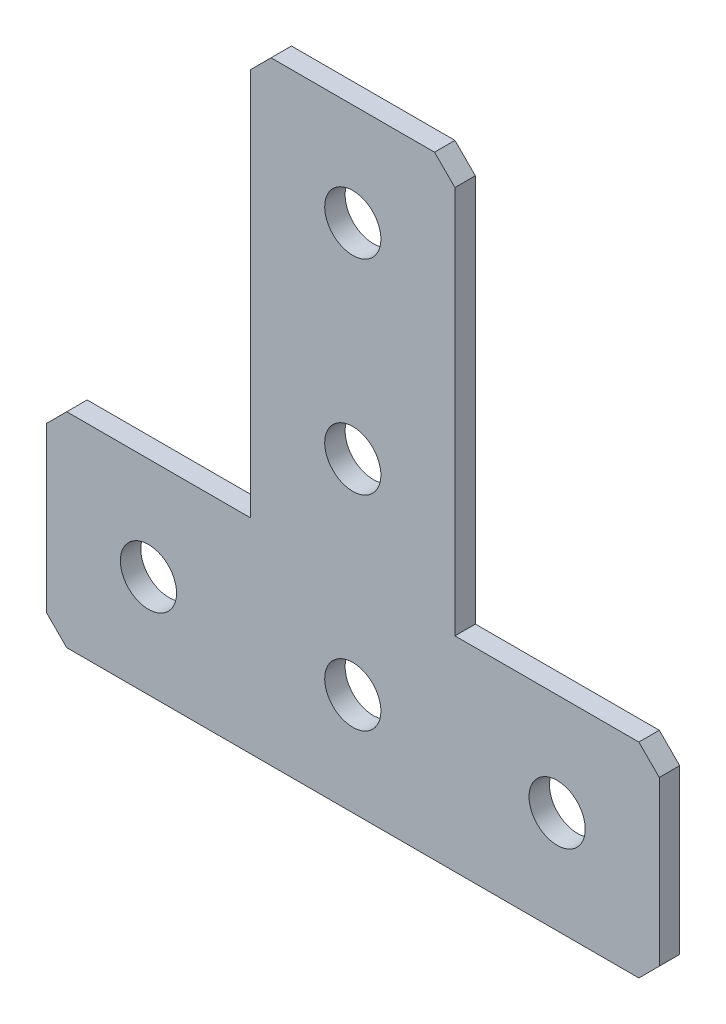
ISO-10303-21;
HEADER;
FILE_DESCRIPTION(('STEP AP214'),'2;1');
FILE_NAME('part.step','',(''),(''),'','','');
FILE_SCHEMA(('AUTOMOTIVE_DESIGN { 1 0 10303 214 1 1 1 1 }'));
ENDSEC;
DATA;
#1=APPLICATION_CONTEXT('core data for automotive mechanical design processes');
#2=APPLICATION_PROTOCOL_DEFINITION('international standard','automotive_design',2000,#1);
#3=PRODUCT_CONTEXT('',#1,'mechanical');
#4=PRODUCT('Part','Part','',(#3));
#5=PRODUCT_RELATED_PRODUCT_CATEGORY('part','',(#4));
#6=PRODUCT_DEFINITION_FORMATION('','',#4);
#7=PRODUCT_DEFINITION_CONTEXT('part definition',#1,'design');
#8=PRODUCT_DEFINITION('design','',#6,#7);
#9=PRODUCT_DEFINITION_SHAPE('','',#8);
#10=(LENGTH_UNIT() NAMED_UNIT(*) SI_UNIT(.MILLI.,.METRE.));
#11=(NAMED_UNIT(*) PLANE_ANGLE_UNIT() SI_UNIT($,.RADIAN.));
#12=(NAMED_UNIT(*) SI_UNIT($,.STERADIAN.) SOLID_ANGLE_UNIT());
#13=UNCERTAINTY_MEASURE_WITH_UNIT(LENGTH_MEASURE(1.E-05),#10,'distance_accuracy_value','');
#14=(GEOMETRIC_REPRESENTATION_CONTEXT(3) GLOBAL_UNCERTAINTY_ASSIGNED_CONTEXT((#13)) GLOBAL_UNIT_ASSIGNED_CONTEXT((#10,
#11,#12)) REPRESENTATION_CONTEXT('',''));
#15=CARTESIAN_POINT('',(0.,0.,0.));
#16=DIRECTION('',(0.,0.,1.));
#17=DIRECTION('',(1.,0.,0.));
#18=AXIS2_PLACEMENT_3D('',#15,#16,#17);
#19=CARTESIAN_POINT('',(-10.,-40.,-2.));
#20=DIRECTION('',(1.,0.,0.));
#21=DIRECTION('',(0.,1.,0.));
#22=AXIS2_PLACEMENT_3D('',#19,#20,#21);
#23=PLANE('',#22);
#24=DIRECTION('',(0.,1.,0.));
#25=VECTOR('',#24,1.);
#26=CARTESIAN_POINT('',(-10.,-40.,0.));
#27=LINE('',#26,#25);
#28=CARTESIAN_POINT('',(-10.,-40.,0.));
#29=VERTEX_POINT('',#28);
#30=CARTESIAN_POINT('',(-10.,-2.00000000000001,0.));
#31=VERTEX_POINT('',#30);
#32=EDGE_CURVE('E178',#29,#31,#27,.T.);
#33=ORIENTED_EDGE('',*,*,#32,.T.);
#34=DIRECTION('',(0.,0.,-1.));
#35=VECTOR('',#34,1.);
#36=CARTESIAN_POINT('',(-10.,-2.00000000000001,-2.));
#37=LINE('',#36,#35);
#38=CARTESIAN_POINT('',(-10.,-2.00000000000001,-2.));
#39=VERTEX_POINT('',#38);
#40=EDGE_CURVE('E240',#31,#39,#37,.T.);
#41=ORIENTED_EDGE('',*,*,#40,.T.);
#42=DIRECTION('',(0.,1.,0.));
#43=VECTOR('',#42,1.);
#44=CARTESIAN_POINT('',(-10.,-40.,-2.));
#45=LINE('',#44,#43);
#46=CARTESIAN_POINT('',(-10.,-40.,-2.));
#47=VERTEX_POINT('',#46);
#48=EDGE_CURVE('E198',#47,#39,#45,.T.);
#49=ORIENTED_EDGE('',*,*,#48,.F.);
#50=DIRECTION('',(0.,0.,1.));
#51=VECTOR('',#50,1.);
#52=CARTESIAN_POINT('',(-10.,-40.,-2.));
#53=LINE('',#52,#51);
#54=EDGE_CURVE('E163',#47,#29,#53,.T.);
#55=ORIENTED_EDGE('',*,*,#54,.T.);
#56=EDGE_LOOP('',(#33,#41,#49,#55));
#57=FACE_BOUND('',#56,.T.);
#58=ADVANCED_FACE('F37',(#57),#23,.F.);
#59=CARTESIAN_POINT('',(10.,0.,-2.));
#60=DIRECTION('',(0.,-1.,0.));
#61=DIRECTION('',(0.,0.,-1.));
#62=AXIS2_PLACEMENT_3D('',#59,#60,#61);
#63=PLANE('',#62);
#64=DIRECTION('',(1.,0.,0.));
#65=VECTOR('',#64,1.);
#66=CARTESIAN_POINT('',(10.,0.,-2.));
#67=LINE('',#66,#65);
#68=CARTESIAN_POINT('',(-7.99999999999999,0.,-2.));
#69=VERTEX_POINT('',#68);
#70=CARTESIAN_POINT('',(7.99999999999998,0.,-2.));
#71=VERTEX_POINT('',#70);
#72=EDGE_CURVE('E152',#69,#71,#67,.T.);
#73=ORIENTED_EDGE('',*,*,#72,.F.);
#74=DIRECTION('',(0.,0.,1.));
#75=VECTOR('',#74,1.);
#76=CARTESIAN_POINT('',(-7.99999999999999,0.,-2.));
#77=LINE('',#76,#75);
#78=CARTESIAN_POINT('',(-7.99999999999999,0.,0.));
#79=VERTEX_POINT('',#78);
#80=EDGE_CURVE('E237',#69,#79,#77,.T.);
#81=ORIENTED_EDGE('',*,*,#80,.T.);
#82=DIRECTION('',(1.,0.,0.));
#83=VECTOR('',#82,1.);
#84=CARTESIAN_POINT('',(10.,0.,0.));
#85=LINE('',#84,#83);
#86=CARTESIAN_POINT('',(7.99999999999998,0.,0.));
#87=VERTEX_POINT('',#86);
#88=EDGE_CURVE('E181',#79,#87,#85,.T.);
#89=ORIENTED_EDGE('',*,*,#88,.T.);
#90=DIRECTION('',(0.,0.,-1.));
#91=VECTOR('',#90,1.);
#92=CARTESIAN_POINT('',(7.99999999999998,0.,-2.));
#93=LINE('',#92,#91);
#94=EDGE_CURVE('E235',#87,#71,#93,.T.);
#95=ORIENTED_EDGE('',*,*,#94,.T.);
#96=EDGE_LOOP('',(#73,#81,#89,#95));
#97=FACE_BOUND('',#96,.T.);
#98=ADVANCED_FACE('F288',(#97),#63,.F.);
#99=CARTESIAN_POINT('',(10.,-40.,-2.));
#100=DIRECTION('',(-1.,0.,0.));
#101=DIRECTION('',(0.,-1.,0.));
#102=AXIS2_PLACEMENT_3D('',#99,#100,#101);
#103=PLANE('',#102);
#104=DIRECTION('',(0.,-1.,0.));
#105=VECTOR('',#104,1.);
#106=CARTESIAN_POINT('',(10.,-40.,-2.));
#107=LINE('',#106,#105);
#108=CARTESIAN_POINT('',(10.,-2.00000000000001,-2.));
#109=VERTEX_POINT('',#108);
#110=CARTESIAN_POINT('',(10.,-40.,-2.));
#111=VERTEX_POINT('',#110);
#112=EDGE_CURVE('E139',#109,#111,#107,.T.);
#113=ORIENTED_EDGE('',*,*,#112,.F.);
#114=DIRECTION('',(0.,0.,1.));
#115=VECTOR('',#114,1.);
#116=CARTESIAN_POINT('',(10.,-2.00000000000001,-2.));
#117=LINE('',#116,#115);
#118=CARTESIAN_POINT('',(10.,-2.00000000000001,0.));
#119=VERTEX_POINT('',#118);
#120=EDGE_CURVE('E242',#109,#119,#117,.T.);
#121=ORIENTED_EDGE('',*,*,#120,.T.);
#122=DIRECTION('',(0.,-1.,0.));
#123=VECTOR('',#122,1.);
#124=CARTESIAN_POINT('',(10.,-40.,0.));
#125=LINE('',#124,#123);
#126=CARTESIAN_POINT('',(10.,-40.,0.));
#127=VERTEX_POINT('',#126);
#128=EDGE_CURVE('E158',#119,#127,#125,.T.);
#129=ORIENTED_EDGE('',*,*,#128,.T.);
#130=DIRECTION('',(0.,0.,1.));
#131=VECTOR('',#130,1.);
#132=CARTESIAN_POINT('',(10.,-40.,-2.));
#133=LINE('',#132,#131);
#134=EDGE_CURVE('E155',#111,#127,#133,.T.);
#135=ORIENTED_EDGE('',*,*,#134,.F.);
#136=EDGE_LOOP('',(#113,#121,#129,#135));
#137=FACE_BOUND('',#136,.T.);
#138=ADVANCED_FACE('F156',(#137),#103,.F.);
#139=CARTESIAN_POINT('',(30.,-40.,-2.));
#140=DIRECTION('',(0.,-1.,0.));
#141=DIRECTION('',(0.,0.,-1.));
#142=AXIS2_PLACEMENT_3D('',#139,#140,#141);
#143=PLANE('',#142);
#144=DIRECTION('',(1.,0.,0.));
#145=VECTOR('',#144,1.);
#146=CARTESIAN_POINT('',(30.,-40.,0.));
#147=LINE('',#146,#145);
#148=CARTESIAN_POINT('',(28.,-40.,0.));
#149=VERTEX_POINT('',#148);
#150=EDGE_CURVE('E186',#127,#149,#147,.T.);
#151=ORIENTED_EDGE('',*,*,#150,.T.);
#152=DIRECTION('',(0.,0.,-1.));
#153=VECTOR('',#152,1.);
#154=CARTESIAN_POINT('',(28.,-40.,-2.));
#155=LINE('',#154,#153);
#156=CARTESIAN_POINT('',(28.,-40.,-2.));
#157=VERTEX_POINT('',#156);
#158=EDGE_CURVE('E11',#149,#157,#155,.T.);
#159=ORIENTED_EDGE('',*,*,#158,.T.);
#160=DIRECTION('',(1.,0.,0.));
#161=VECTOR('',#160,1.);
#162=CARTESIAN_POINT('',(30.,-40.,-2.));
#163=LINE('',#162,#161);
#164=EDGE_CURVE('E144',#111,#157,#163,.T.);
#165=ORIENTED_EDGE('',*,*,#164,.F.);
#166=ORIENTED_EDGE('',*,*,#134,.T.);
#167=EDGE_LOOP('',(#151,#159,#165,#166));
#168=FACE_BOUND('',#167,.T.);
#169=ADVANCED_FACE('F165',(#168),#143,.F.);
#170=CARTESIAN_POINT('',(30.,-60.,-2.));
#171=DIRECTION('',(-1.,0.,0.));
#172=DIRECTION('',(0.,-1.,0.));
#173=AXIS2_PLACEMENT_3D('',#170,#171,#172);
#174=PLANE('',#173);
#175=DIRECTION('',(0.,-1.,0.));
#176=VECTOR('',#175,1.);
#177=CARTESIAN_POINT('',(30.,-60.,-2.));
#178=LINE('',#177,#176);
#179=CARTESIAN_POINT('',(30.,-42.,-2.));
#180=VERTEX_POINT('',#179);
#181=CARTESIAN_POINT('',(30.,-58.,-2.));
#182=VERTEX_POINT('',#181);
#183=EDGE_CURVE('E167',#180,#182,#178,.T.);
#184=ORIENTED_EDGE('',*,*,#183,.F.);
#185=DIRECTION('',(0.,0.,1.));
#186=VECTOR('',#185,1.);
#187=CARTESIAN_POINT('',(30.,-42.,-2.));
#188=LINE('',#187,#186);
#189=CARTESIAN_POINT('',(30.,-42.,0.));
#190=VERTEX_POINT('',#189);
#191=EDGE_CURVE('E45',#180,#190,#188,.T.);
#192=ORIENTED_EDGE('',*,*,#191,.T.);
#193=DIRECTION('',(0.,-1.,0.));
#194=VECTOR('',#193,1.);
#195=CARTESIAN_POINT('',(30.,-60.,0.));
#196=LINE('',#195,#194);
#197=CARTESIAN_POINT('',(30.,-58.,0.));
#198=VERTEX_POINT('',#197);
#199=EDGE_CURVE('E188',#190,#198,#196,.T.);
#200=ORIENTED_EDGE('',*,*,#199,.T.);
#201=DIRECTION('',(0.,0.,-1.));
#202=VECTOR('',#201,1.);
#203=CARTESIAN_POINT('',(30.,-58.,-2.));
#204=LINE('',#203,#202);
#205=EDGE_CURVE('E60',#198,#182,#204,.T.);
#206=ORIENTED_EDGE('',*,*,#205,.T.);
#207=EDGE_LOOP('',(#184,#192,#200,#206));
#208=FACE_BOUND('',#207,.T.);
#209=ADVANCED_FACE('F247',(#208),#174,.F.);
#210=CARTESIAN_POINT('',(-30.,-60.,-2.));
#211=DIRECTION('',(0.,1.,0.));
#212=DIRECTION('',(0.,0.,1.));
#213=AXIS2_PLACEMENT_3D('',#210,#211,#212);
#214=PLANE('',#213);
#215=DIRECTION('',(-1.,0.,0.));
#216=VECTOR('',#215,1.);
#217=CARTESIAN_POINT('',(-30.,-60.,0.));
#218=LINE('',#217,#216);
#219=CARTESIAN_POINT('',(28.,-60.,0.));
#220=VERTEX_POINT('',#219);
#221=CARTESIAN_POINT('',(-28.,-60.,0.));
#222=VERTEX_POINT('',#221);
#223=EDGE_CURVE('E190',#220,#222,#218,.T.);
#224=ORIENTED_EDGE('',*,*,#223,.T.);
#225=DIRECTION('',(0.,0.,-1.));
#226=VECTOR('',#225,1.);
#227=CARTESIAN_POINT('',(-28.,-60.,-2.));
#228=LINE('',#227,#226);
#229=CARTESIAN_POINT('',(-28.,-60.,-2.));
#230=VERTEX_POINT('',#229);
#231=EDGE_CURVE('E220',#222,#230,#228,.T.);
#232=ORIENTED_EDGE('',*,*,#231,.T.);
#233=DIRECTION('',(-1.,0.,0.));
#234=VECTOR('',#233,1.);
#235=CARTESIAN_POINT('',(-30.,-60.,-2.));
#236=LINE('',#235,#234);
#237=CARTESIAN_POINT('',(28.,-60.,-2.));
#238=VERTEX_POINT('',#237);
#239=EDGE_CURVE('E169',#238,#230,#236,.T.);
#240=ORIENTED_EDGE('',*,*,#239,.F.);
#241=DIRECTION('',(0.,0.,1.));
#242=VECTOR('',#241,1.);
#243=CARTESIAN_POINT('',(28.,-60.,-2.));
#244=LINE('',#243,#242);
#245=EDGE_CURVE('E217',#238,#220,#244,.T.);
#246=ORIENTED_EDGE('',*,*,#245,.T.);
#247=EDGE_LOOP('',(#224,#232,#240,#246));
#248=FACE_BOUND('',#247,.T.);
#249=ADVANCED_FACE('F258',(#248),#214,.F.);
#250=CARTESIAN_POINT('',(-30.,-60.,-2.));
#251=DIRECTION('',(1.,0.,0.));
#252=DIRECTION('',(0.,1.,0.));
#253=AXIS2_PLACEMENT_3D('',#250,#251,#252);
#254=PLANE('',#253);
#255=DIRECTION('',(0.,1.,0.));
#256=VECTOR('',#255,1.);
#257=CARTESIAN_POINT('',(-30.,-60.,-2.));
#258=LINE('',#257,#256);
#259=CARTESIAN_POINT('',(-30.,-58.,-2.));
#260=VERTEX_POINT('',#259);
#261=CARTESIAN_POINT('',(-30.,-42.,-2.));
#262=VERTEX_POINT('',#261);
#263=EDGE_CURVE('E174',#260,#262,#258,.T.);
#264=ORIENTED_EDGE('',*,*,#263,.F.);
#265=DIRECTION('',(0.,0.,1.));
#266=VECTOR('',#265,1.);
#267=CARTESIAN_POINT('',(-30.,-58.,-2.));
#268=LINE('',#267,#266);
#269=CARTESIAN_POINT('',(-30.,-58.,0.));
#270=VERTEX_POINT('',#269);
#271=EDGE_CURVE('E202',#260,#270,#268,.T.);
#272=ORIENTED_EDGE('',*,*,#271,.T.);
#273=DIRECTION('',(0.,1.,0.));
#274=VECTOR('',#273,1.);
#275=CARTESIAN_POINT('',(-30.,-60.,0.));
#276=LINE('',#275,#274);
#277=CARTESIAN_POINT('',(-30.,-42.,0.));
#278=VERTEX_POINT('',#277);
#279=EDGE_CURVE('E193',#270,#278,#276,.T.);
#280=ORIENTED_EDGE('',*,*,#279,.T.);
#281=DIRECTION('',(0.,0.,-1.));
#282=VECTOR('',#281,1.);
#283=CARTESIAN_POINT('',(-30.,-42.,-2.));
#284=LINE('',#283,#282);
#285=EDGE_CURVE('E162',#278,#262,#284,.T.);
#286=ORIENTED_EDGE('',*,*,#285,.T.);
#287=EDGE_LOOP('',(#264,#272,#280,#286));
#288=FACE_BOUND('',#287,.T.);
#289=ADVANCED_FACE('F266',(#288),#254,.F.);
#290=CARTESIAN_POINT('',(-30.,-40.,-2.));
#291=DIRECTION('',(0.,-1.,0.));
#292=DIRECTION('',(0.,0.,-1.));
#293=AXIS2_PLACEMENT_3D('',#290,#291,#292);
#294=PLANE('',#293);
#295=DIRECTION('',(1.,0.,0.));
#296=VECTOR('',#295,1.);
#297=CARTESIAN_POINT('',(-30.,-40.,-2.));
#298=LINE('',#297,#296);
#299=CARTESIAN_POINT('',(-28.,-40.,-2.));
#300=VERTEX_POINT('',#299);
#301=EDGE_CURVE('E176',#300,#47,#298,.T.);
#302=ORIENTED_EDGE('',*,*,#301,.F.);
#303=DIRECTION('',(0.,0.,1.));
#304=VECTOR('',#303,1.);
#305=CARTESIAN_POINT('',(-28.,-40.,-2.));
#306=LINE('',#305,#304);
#307=CARTESIAN_POINT('',(-28.,-40.,0.));
#308=VERTEX_POINT('',#307);
#309=EDGE_CURVE('E232',#300,#308,#306,.T.);
#310=ORIENTED_EDGE('',*,*,#309,.T.);
#311=DIRECTION('',(1.,0.,0.));
#312=VECTOR('',#311,1.);
#313=CARTESIAN_POINT('',(-30.,-40.,0.));
#314=LINE('',#313,#312);
#315=EDGE_CURVE('E196',#308,#29,#314,.T.);
#316=ORIENTED_EDGE('',*,*,#315,.T.);
#317=ORIENTED_EDGE('',*,*,#54,.F.);
#318=EDGE_LOOP('',(#302,#310,#316,#317));
#319=FACE_BOUND('',#318,.T.);
#320=ADVANCED_FACE('F274',(#319),#294,.F.);
#321=CARTESIAN_POINT('',(0.,0.,-2.));
#322=DIRECTION('',(0.,0.,1.));
#323=DIRECTION('',(1.,0.,0.));
#324=AXIS2_PLACEMENT_3D('',#321,#322,#323);
#325=PLANE('',#324);
#326=CARTESIAN_POINT('',(0.,-50.,-2.));
#327=DIRECTION('',(0.,0.,-1.));
#328=DIRECTION('',(0.,1.,0.));
#329=AXIS2_PLACEMENT_3D('',#326,#327,#328);
#330=CIRCLE('',#329,2.75);
#331=CARTESIAN_POINT('',(0.,-47.25,-2.));
#332=VERTEX_POINT('',#331);
#333=EDGE_CURVE('E319',#332,#332,#330,.T.);
#334=ORIENTED_EDGE('',*,*,#333,.F.);
#335=EDGE_LOOP('',(#334));
#336=FACE_BOUND('',#335,.T.);
#337=CARTESIAN_POINT('',(-20.,-50.,-2.));
#338=DIRECTION('',(0.,0.,-1.));
#339=DIRECTION('',(0.,1.,0.));
#340=AXIS2_PLACEMENT_3D('',#337,#338,#339);
#341=CIRCLE('',#340,2.75);
#342=CARTESIAN_POINT('',(-20.,-47.25,-2.));
#343=VERTEX_POINT('',#342);
#344=EDGE_CURVE('E313',#343,#343,#341,.T.);
#345=ORIENTED_EDGE('',*,*,#344,.F.);
#346=EDGE_LOOP('',(#345));
#347=FACE_BOUND('',#346,.T.);
#348=CARTESIAN_POINT('',(20.,-50.,-2.));
#349=DIRECTION('',(0.,0.,-1.));
#350=DIRECTION('',(0.,1.,0.));
#351=AXIS2_PLACEMENT_3D('',#348,#349,#350);
#352=CIRCLE('',#351,2.75);
#353=CARTESIAN_POINT('',(20.,-47.25,-2.));
#354=VERTEX_POINT('',#353);
#355=EDGE_CURVE('E307',#354,#354,#352,.T.);
#356=ORIENTED_EDGE('',*,*,#355,.F.);
#357=EDGE_LOOP('',(#356));
#358=FACE_BOUND('',#357,.T.);
#359=CARTESIAN_POINT('',(0.,-30.,-2.));
#360=DIRECTION('',(0.,0.,-1.));
#361=DIRECTION('',(0.,1.,0.));
#362=AXIS2_PLACEMENT_3D('',#359,#360,#361);
#363=CIRCLE('',#362,2.75);
#364=CARTESIAN_POINT('',(0.,-27.25,-2.));
#365=VERTEX_POINT('',#364);
#366=EDGE_CURVE('E301',#365,#365,#363,.T.);
#367=ORIENTED_EDGE('',*,*,#366,.F.);
#368=EDGE_LOOP('',(#367));
#369=FACE_BOUND('',#368,.T.);
#370=CARTESIAN_POINT('',(0.,-9.99999999999999,-2.));
#371=DIRECTION('',(0.,0.,-1.));
#372=DIRECTION('',(0.,1.,0.));
#373=AXIS2_PLACEMENT_3D('',#370,#371,#372);
#374=CIRCLE('',#373,2.75);
#375=CARTESIAN_POINT('',(0.,-7.25,-2.));
#376=VERTEX_POINT('',#375);
#377=EDGE_CURVE('E295',#376,#376,#374,.T.);
#378=ORIENTED_EDGE('',*,*,#377,.F.);
#379=EDGE_LOOP('',(#378));
#380=FACE_BOUND('',#379,.T.);
#381=ORIENTED_EDGE('',*,*,#239,.T.);
#382=DIRECTION('',(0.707106781186549,-0.707106781186546,0.));
#383=VECTOR('',#382,1.);
#384=CARTESIAN_POINT('',(-30.,-58.,-2.));
#385=LINE('',#384,#383);
#386=EDGE_CURVE('E230',#230,#260,#385,.F.);
#387=ORIENTED_EDGE('',*,*,#386,.T.);
#388=ORIENTED_EDGE('',*,*,#263,.T.);
#389=DIRECTION('',(-0.707106781186546,-0.707106781186549,0.));
#390=VECTOR('',#389,1.);
#391=CARTESIAN_POINT('',(-28.,-40.,-2.));
#392=LINE('',#391,#390);
#393=EDGE_CURVE('E52',#262,#300,#392,.F.);
#394=ORIENTED_EDGE('',*,*,#393,.T.);
#395=ORIENTED_EDGE('',*,*,#301,.T.);
#396=ORIENTED_EDGE('',*,*,#48,.T.);
#397=DIRECTION('',(-0.707106781186547,-0.707106781186549,0.));
#398=VECTOR('',#397,1.);
#399=CARTESIAN_POINT('',(-7.99999999999999,0.,-2.));
#400=LINE('',#399,#398);
#401=EDGE_CURVE('E227',#39,#69,#400,.F.);
#402=ORIENTED_EDGE('',*,*,#401,.T.);
#403=ORIENTED_EDGE('',*,*,#72,.T.);
#404=DIRECTION('',(-0.707106781186548,0.707106781186547,0.));
#405=VECTOR('',#404,1.);
#406=CARTESIAN_POINT('',(10.,-2.00000000000001,-2.));
#407=LINE('',#406,#405);
#408=EDGE_CURVE('E148',#71,#109,#407,.F.);
#409=ORIENTED_EDGE('',*,*,#408,.T.);
#410=ORIENTED_EDGE('',*,*,#112,.T.);
#411=ORIENTED_EDGE('',*,*,#164,.T.);
#412=DIRECTION('',(-0.707106781186549,0.707106781186546,0.));
#413=VECTOR('',#412,1.);
#414=CARTESIAN_POINT('',(30.,-42.,-2.));
#415=LINE('',#414,#413);
#416=EDGE_CURVE('E224',#157,#180,#415,.F.);
#417=ORIENTED_EDGE('',*,*,#416,.T.);
#418=ORIENTED_EDGE('',*,*,#183,.T.);
#419=DIRECTION('',(0.707106781186546,0.707106781186549,0.));
#420=VECTOR('',#419,1.);
#421=CARTESIAN_POINT('',(28.,-60.,-2.));
#422=LINE('',#421,#420);
#423=EDGE_CURVE('E222',#182,#238,#422,.F.);
#424=ORIENTED_EDGE('',*,*,#423,.T.);
#425=EDGE_LOOP('',(#381,#387,#388,#394,#395,#396,#402,#403,#409,#410,#411,#417,#418,#424));
#426=FACE_BOUND('',#425,.T.);
#427=ADVANCED_FACE('F142',(#336,#347,#358,#369,#380,#426),#325,.F.);
#428=CARTESIAN_POINT('',(0.,0.,0.));
#429=DIRECTION('',(0.,0.,1.));
#430=DIRECTION('',(1.,0.,0.));
#431=AXIS2_PLACEMENT_3D('',#428,#429,#430);
#432=PLANE('',#431);
#433=CARTESIAN_POINT('',(0.,-50.,0.));
#434=DIRECTION('',(0.,0.,-1.));
#435=DIRECTION('',(0.,1.,0.));
#436=AXIS2_PLACEMENT_3D('',#433,#434,#435);
#437=CIRCLE('',#436,2.75);
#438=CARTESIAN_POINT('',(0.,-47.25,0.));
#439=VERTEX_POINT('',#438);
#440=EDGE_CURVE('E316',#439,#439,#437,.T.);
#441=ORIENTED_EDGE('',*,*,#440,.T.);
#442=EDGE_LOOP('',(#441));
#443=FACE_BOUND('',#442,.T.);
#444=CARTESIAN_POINT('',(-20.,-50.,0.));
#445=DIRECTION('',(0.,0.,-1.));
#446=DIRECTION('',(0.,1.,0.));
#447=AXIS2_PLACEMENT_3D('',#444,#445,#446);
#448=CIRCLE('',#447,2.75);
#449=CARTESIAN_POINT('',(-20.,-47.25,0.));
#450=VERTEX_POINT('',#449);
#451=EDGE_CURVE('E310',#450,#450,#448,.T.);
#452=ORIENTED_EDGE('',*,*,#451,.T.);
#453=EDGE_LOOP('',(#452));
#454=FACE_BOUND('',#453,.T.);
#455=CARTESIAN_POINT('',(20.,-50.,0.));
#456=DIRECTION('',(0.,0.,-1.));
#457=DIRECTION('',(0.,1.,0.));
#458=AXIS2_PLACEMENT_3D('',#455,#456,#457);
#459=CIRCLE('',#458,2.75);
#460=CARTESIAN_POINT('',(20.,-47.25,0.));
#461=VERTEX_POINT('',#460);
#462=EDGE_CURVE('E304',#461,#461,#459,.T.);
#463=ORIENTED_EDGE('',*,*,#462,.T.);
#464=EDGE_LOOP('',(#463));
#465=FACE_BOUND('',#464,.T.);
#466=CARTESIAN_POINT('',(0.,-30.,0.));
#467=DIRECTION('',(0.,0.,-1.));
#468=DIRECTION('',(0.,1.,0.));
#469=AXIS2_PLACEMENT_3D('',#466,#467,#468);
#470=CIRCLE('',#469,2.75);
#471=CARTESIAN_POINT('',(0.,-27.25,0.));
#472=VERTEX_POINT('',#471);
#473=EDGE_CURVE('E298',#472,#472,#470,.T.);
#474=ORIENTED_EDGE('',*,*,#473,.T.);
#475=EDGE_LOOP('',(#474));
#476=FACE_BOUND('',#475,.T.);
#477=CARTESIAN_POINT('',(0.,-9.99999999999999,0.));
#478=DIRECTION('',(0.,0.,-1.));
#479=DIRECTION('',(0.,1.,0.));
#480=AXIS2_PLACEMENT_3D('',#477,#478,#479);
#481=CIRCLE('',#480,2.75);
#482=CARTESIAN_POINT('',(0.,-7.25,0.));
#483=VERTEX_POINT('',#482);
#484=EDGE_CURVE('E182',#483,#483,#481,.T.);
#485=ORIENTED_EDGE('',*,*,#484,.T.);
#486=EDGE_LOOP('',(#485));
#487=FACE_BOUND('',#486,.T.);
#488=ORIENTED_EDGE('',*,*,#279,.F.);
#489=DIRECTION('',(-0.707106781186549,0.707106781186546,0.));
#490=VECTOR('',#489,1.);
#491=CARTESIAN_POINT('',(-44.,-44.0000000000001,0.));
#492=LINE('',#491,#490);
#493=EDGE_CURVE('E215',#270,#222,#492,.F.);
#494=ORIENTED_EDGE('',*,*,#493,.T.);
#495=ORIENTED_EDGE('',*,*,#223,.F.);
#496=DIRECTION('',(-0.707106781186546,-0.707106781186549,0.));
#497=VECTOR('',#496,1.);
#498=CARTESIAN_POINT('',(44.,-43.9999999999999,0.));
#499=LINE('',#498,#497);
#500=EDGE_CURVE('E205',#220,#198,#499,.F.);
#501=ORIENTED_EDGE('',*,*,#500,.T.);
#502=ORIENTED_EDGE('',*,*,#199,.F.);
#503=DIRECTION('',(0.707106781186549,-0.707106781186546,0.));
#504=VECTOR('',#503,1.);
#505=CARTESIAN_POINT('',(-6.00000000000005,-6.00000000000007,0.));
#506=LINE('',#505,#504);
#507=EDGE_CURVE('E207',#190,#149,#506,.F.);
#508=ORIENTED_EDGE('',*,*,#507,.T.);
#509=ORIENTED_EDGE('',*,*,#150,.F.);
#510=ORIENTED_EDGE('',*,*,#128,.F.);
#511=DIRECTION('',(0.707106781186548,-0.707106781186547,0.));
#512=VECTOR('',#511,1.);
#513=CARTESIAN_POINT('',(3.99999999999998,3.99999999999999,0.));
#514=LINE('',#513,#512);
#515=EDGE_CURVE('E209',#119,#87,#514,.F.);
#516=ORIENTED_EDGE('',*,*,#515,.T.);
#517=ORIENTED_EDGE('',*,*,#88,.F.);
#518=DIRECTION('',(0.707106781186547,0.707106781186549,0.));
#519=VECTOR('',#518,1.);
#520=CARTESIAN_POINT('',(-4.00000000000001,4.,0.));
#521=LINE('',#520,#519);
#522=EDGE_CURVE('E211',#79,#31,#521,.F.);
#523=ORIENTED_EDGE('',*,*,#522,.T.);
#524=ORIENTED_EDGE('',*,*,#32,.F.);
#525=ORIENTED_EDGE('',*,*,#315,.F.);
#526=DIRECTION('',(0.707106781186546,0.707106781186549,0.));
#527=VECTOR('',#526,1.);
#528=CARTESIAN_POINT('',(5.99999999999995,-5.99999999999993,0.));
#529=LINE('',#528,#527);
#530=EDGE_CURVE('E213',#308,#278,#529,.F.);
#531=ORIENTED_EDGE('',*,*,#530,.T.);
#532=EDGE_LOOP('',(#488,#494,#495,#501,#502,#508,#509,#510,#516,#517,#523,#524,#525,#531));
#533=FACE_BOUND('',#532,.T.);
#534=ADVANCED_FACE('F251',(#443,#454,#465,#476,#487,#533),#432,.T.);
#535=CARTESIAN_POINT('',(0.,-9.99999999999999,-2.));
#536=DIRECTION('',(0.,0.,-1.));
#537=DIRECTION('',(0.,1.,0.));
#538=AXIS2_PLACEMENT_3D('',#535,#536,#537);
#539=CYLINDRICAL_SURFACE('',#538,2.75);
#540=ORIENTED_EDGE('',*,*,#484,.F.);
#541=EDGE_LOOP('',(#540));
#542=FACE_BOUND('',#541,.T.);
#543=ORIENTED_EDGE('',*,*,#377,.T.);
#544=EDGE_LOOP('',(#543));
#545=FACE_BOUND('',#544,.T.);
#546=ADVANCED_FACE('F336',(#542,#545),#539,.F.);
#547=CARTESIAN_POINT('',(0.,-30.,-2.));
#548=DIRECTION('',(0.,0.,-1.));
#549=DIRECTION('',(0.,1.,0.));
#550=AXIS2_PLACEMENT_3D('',#547,#548,#549);
#551=CYLINDRICAL_SURFACE('',#550,2.75);
#552=ORIENTED_EDGE('',*,*,#473,.F.);
#553=EDGE_LOOP('',(#552));
#554=FACE_BOUND('',#553,.T.);
#555=ORIENTED_EDGE('',*,*,#366,.T.);
#556=EDGE_LOOP('',(#555));
#557=FACE_BOUND('',#556,.T.);
#558=ADVANCED_FACE('F338',(#554,#557),#551,.F.);
#559=CARTESIAN_POINT('',(20.,-50.,-2.));
#560=DIRECTION('',(0.,0.,-1.));
#561=DIRECTION('',(0.,1.,0.));
#562=AXIS2_PLACEMENT_3D('',#559,#560,#561);
#563=CYLINDRICAL_SURFACE('',#562,2.75);
#564=ORIENTED_EDGE('',*,*,#462,.F.);
#565=EDGE_LOOP('',(#564));
#566=FACE_BOUND('',#565,.T.);
#567=ORIENTED_EDGE('',*,*,#355,.T.);
#568=EDGE_LOOP('',(#567));
#569=FACE_BOUND('',#568,.T.);
#570=ADVANCED_FACE('F345',(#566,#569),#563,.F.);
#571=CARTESIAN_POINT('',(-20.,-50.,-2.));
#572=DIRECTION('',(0.,0.,-1.));
#573=DIRECTION('',(0.,1.,0.));
#574=AXIS2_PLACEMENT_3D('',#571,#572,#573);
#575=CYLINDRICAL_SURFACE('',#574,2.75);
#576=ORIENTED_EDGE('',*,*,#451,.F.);
#577=EDGE_LOOP('',(#576));
#578=FACE_BOUND('',#577,.T.);
#579=ORIENTED_EDGE('',*,*,#344,.T.);
#580=EDGE_LOOP('',(#579));
#581=FACE_BOUND('',#580,.T.);
#582=ADVANCED_FACE('F480',(#578,#581),#575,.F.);
#583=CARTESIAN_POINT('',(0.,-50.,-2.));
#584=DIRECTION('',(0.,0.,-1.));
#585=DIRECTION('',(0.,1.,0.));
#586=AXIS2_PLACEMENT_3D('',#583,#584,#585);
#587=CYLINDRICAL_SURFACE('',#586,2.75);
#588=ORIENTED_EDGE('',*,*,#440,.F.);
#589=EDGE_LOOP('',(#588));
#590=FACE_BOUND('',#589,.T.);
#591=ORIENTED_EDGE('',*,*,#333,.T.);
#592=EDGE_LOOP('',(#591));
#593=FACE_BOUND('',#592,.T.);
#594=ADVANCED_FACE('F323',(#590,#593),#587,.F.);
#595=CARTESIAN_POINT('',(-30.,-58.,-2.));
#596=DIRECTION('',(0.707106781186546,0.707106781186549,0.));
#597=DIRECTION('',(0.,0.,1.));
#598=AXIS2_PLACEMENT_3D('',#595,#596,#597);
#599=PLANE('',#598);
#600=ORIENTED_EDGE('',*,*,#386,.F.);
#601=ORIENTED_EDGE('',*,*,#231,.F.);
#602=ORIENTED_EDGE('',*,*,#493,.F.);
#603=ORIENTED_EDGE('',*,*,#271,.F.);
#604=EDGE_LOOP('',(#600,#601,#602,#603));
#605=FACE_BOUND('',#604,.T.);
#606=ADVANCED_FACE('F264',(#605),#599,.F.);
#607=CARTESIAN_POINT('',(-28.,-40.,-2.));
#608=DIRECTION('',(0.707106781186549,-0.707106781186546,0.));
#609=DIRECTION('',(0.,0.,1.));
#610=AXIS2_PLACEMENT_3D('',#607,#608,#609);
#611=PLANE('',#610);
#612=ORIENTED_EDGE('',*,*,#393,.F.);
#613=ORIENTED_EDGE('',*,*,#285,.F.);
#614=ORIENTED_EDGE('',*,*,#530,.F.);
#615=ORIENTED_EDGE('',*,*,#309,.F.);
#616=EDGE_LOOP('',(#612,#613,#614,#615));
#617=FACE_BOUND('',#616,.T.);
#618=ADVANCED_FACE('F272',(#617),#611,.F.);
#619=CARTESIAN_POINT('',(-7.99999999999999,0.,-2.));
#620=DIRECTION('',(0.707106781186548,-0.707106781186546,0.));
#621=DIRECTION('',(0.,0.,1.));
#622=AXIS2_PLACEMENT_3D('',#619,#620,#621);
#623=PLANE('',#622);
#624=ORIENTED_EDGE('',*,*,#401,.F.);
#625=ORIENTED_EDGE('',*,*,#40,.F.);
#626=ORIENTED_EDGE('',*,*,#522,.F.);
#627=ORIENTED_EDGE('',*,*,#80,.F.);
#628=EDGE_LOOP('',(#624,#625,#626,#627));
#629=FACE_BOUND('',#628,.T.);
#630=ADVANCED_FACE('F285',(#629),#623,.F.);
#631=CARTESIAN_POINT('',(10.,-2.00000000000001,-2.));
#632=DIRECTION('',(-0.707106781186547,-0.707106781186548,0.));
#633=DIRECTION('',(0.,0.,1.));
#634=AXIS2_PLACEMENT_3D('',#631,#632,#633);
#635=PLANE('',#634);
#636=ORIENTED_EDGE('',*,*,#408,.F.);
#637=ORIENTED_EDGE('',*,*,#94,.F.);
#638=ORIENTED_EDGE('',*,*,#515,.F.);
#639=ORIENTED_EDGE('',*,*,#120,.F.);
#640=EDGE_LOOP('',(#636,#637,#638,#639));
#641=FACE_BOUND('',#640,.T.);
#642=ADVANCED_FACE('F291',(#641),#635,.F.);
#643=CARTESIAN_POINT('',(30.,-42.,-2.));
#644=DIRECTION('',(-0.707106781186546,-0.707106781186549,0.));
#645=DIRECTION('',(0.,0.,1.));
#646=AXIS2_PLACEMENT_3D('',#643,#644,#645);
#647=PLANE('',#646);
#648=ORIENTED_EDGE('',*,*,#416,.F.);
#649=ORIENTED_EDGE('',*,*,#158,.F.);
#650=ORIENTED_EDGE('',*,*,#507,.F.);
#651=ORIENTED_EDGE('',*,*,#191,.F.);
#652=EDGE_LOOP('',(#648,#649,#650,#651));
#653=FACE_BOUND('',#652,.T.);
#654=ADVANCED_FACE('F366',(#653),#647,.F.);
#655=CARTESIAN_POINT('',(28.,-60.,-2.));
#656=DIRECTION('',(-0.707106781186549,0.707106781186546,0.));
#657=DIRECTION('',(0.,0.,1.));
#658=AXIS2_PLACEMENT_3D('',#655,#656,#657);
#659=PLANE('',#658);
#660=ORIENTED_EDGE('',*,*,#423,.F.);
#661=ORIENTED_EDGE('',*,*,#205,.F.);
#662=ORIENTED_EDGE('',*,*,#500,.F.);
#663=ORIENTED_EDGE('',*,*,#245,.F.);
#664=EDGE_LOOP('',(#660,#661,#662,#663));
#665=FACE_BOUND('',#664,.T.);
#666=ADVANCED_FACE('F39',(#665),#659,.F.);
#667=CLOSED_SHELL('',(#58,#98,#138,#169,#209,#249,#289,#320,#427,#534,#546,#558,#570,#582,#594,
#606,#618,#630,#642,#654,#666));
#668=MANIFOLD_SOLID_BREP('B2',#667);
#669=ADVANCED_BREP_SHAPE_REPRESENTATION('',(#18,#668),#14);
#670=SHAPE_DEFINITION_REPRESENTATION(#9,#669);
ENDSEC;
END-ISO-10303-21;
